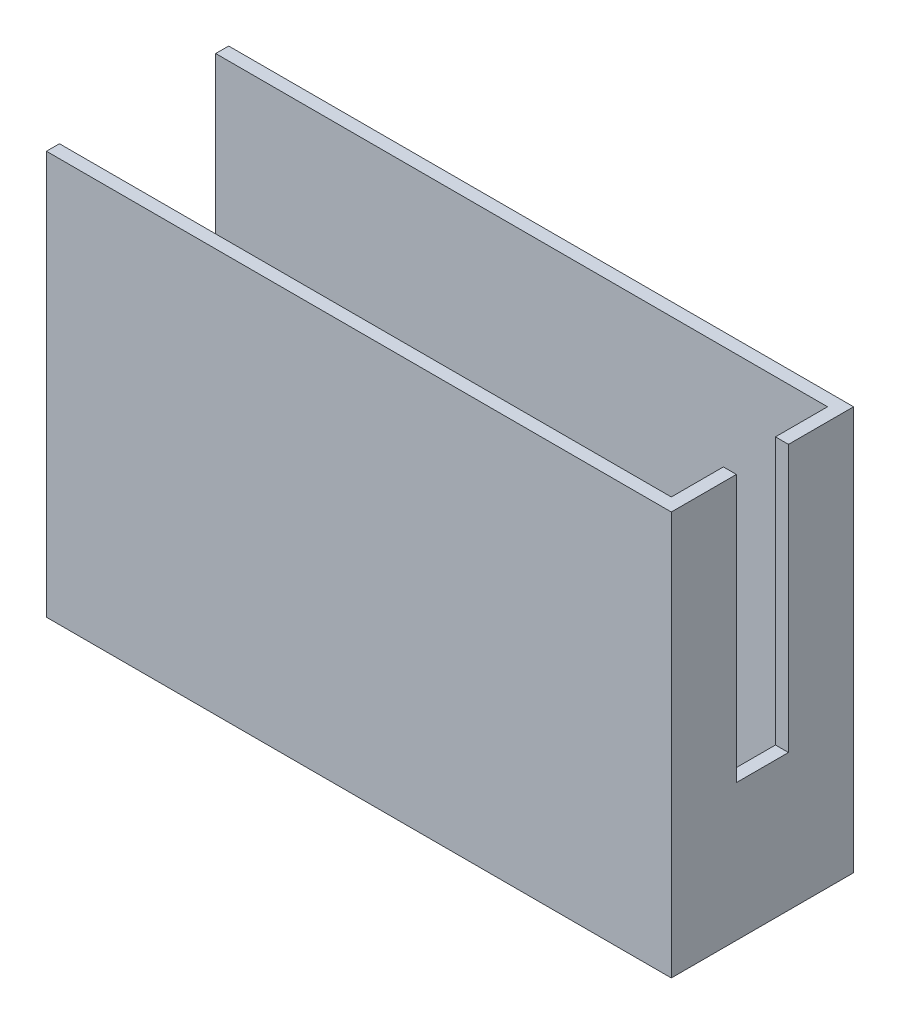
ISO-10303-21;
HEADER;
FILE_DESCRIPTION(('STEP AP214'),'2;1');
FILE_NAME('part.step','',(''),(''),'','','');
FILE_SCHEMA(('AUTOMOTIVE_DESIGN { 1 0 10303 214 1 1 1 1 }'));
ENDSEC;
DATA;
#1=APPLICATION_CONTEXT('core data for automotive mechanical design processes');
#2=APPLICATION_PROTOCOL_DEFINITION('international standard','automotive_design',2000,#1);
#3=PRODUCT_CONTEXT('',#1,'mechanical');
#4=PRODUCT('Part','Part','',(#3));
#5=PRODUCT_RELATED_PRODUCT_CATEGORY('part','',(#4));
#6=PRODUCT_DEFINITION_FORMATION('','',#4);
#7=PRODUCT_DEFINITION_CONTEXT('part definition',#1,'design');
#8=PRODUCT_DEFINITION('design','',#6,#7);
#9=PRODUCT_DEFINITION_SHAPE('','',#8);
#10=(LENGTH_UNIT() NAMED_UNIT(*) SI_UNIT(.MILLI.,.METRE.));
#11=(NAMED_UNIT(*) PLANE_ANGLE_UNIT() SI_UNIT($,.RADIAN.));
#12=(NAMED_UNIT(*) SI_UNIT($,.STERADIAN.) SOLID_ANGLE_UNIT());
#13=UNCERTAINTY_MEASURE_WITH_UNIT(LENGTH_MEASURE(1.E-05),#10,'distance_accuracy_value','');
#14=(GEOMETRIC_REPRESENTATION_CONTEXT(3) GLOBAL_UNCERTAINTY_ASSIGNED_CONTEXT((#13)) GLOBAL_UNIT_ASSIGNED_CONTEXT((#10,
#11,#12)) REPRESENTATION_CONTEXT('',''));
#15=CARTESIAN_POINT('',(0.,0.,0.));
#16=DIRECTION('',(0.,0.,1.));
#17=DIRECTION('',(1.,0.,0.));
#18=AXIS2_PLACEMENT_3D('',#15,#16,#17);
#19=CARTESIAN_POINT('',(0.,62.,0.));
#20=DIRECTION('',(0.,-1.,0.));
#21=DIRECTION('',(0.,0.,-1.));
#22=AXIS2_PLACEMENT_3D('',#19,#20,#21);
#23=PLANE('',#22);
#24=DIRECTION('',(0.,0.,1.));
#25=VECTOR('',#24,1.);
#26=CARTESIAN_POINT('',(0.,62.,0.));
#27=LINE('',#26,#25);
#28=CARTESIAN_POINT('',(0.,62.,-28.));
#29=VERTEX_POINT('',#28);
#30=CARTESIAN_POINT('',(0.,62.,-26.));
#31=VERTEX_POINT('',#30);
#32=EDGE_CURVE('E236',#29,#31,#27,.T.);
#33=ORIENTED_EDGE('',*,*,#32,.T.);
#34=DIRECTION('',(-1.,0.,0.));
#35=VECTOR('',#34,1.);
#36=CARTESIAN_POINT('',(2.,62.,-26.));
#37=LINE('',#36,#35);
#38=CARTESIAN_POINT('',(94.,62.,-26.));
#39=VERTEX_POINT('',#38);
#40=EDGE_CURVE('E156',#39,#31,#37,.T.);
#41=ORIENTED_EDGE('',*,*,#40,.F.);
#42=DIRECTION('',(0.,0.,-1.));
#43=VECTOR('',#42,1.);
#44=CARTESIAN_POINT('',(94.,62.,-2.));
#45=LINE('',#44,#43);
#46=CARTESIAN_POINT('',(94.,62.,-18.));
#47=VERTEX_POINT('',#46);
#48=EDGE_CURVE('E215',#47,#39,#45,.T.);
#49=ORIENTED_EDGE('',*,*,#48,.F.);
#50=DIRECTION('',(1.,0.,0.));
#51=VECTOR('',#50,1.);
#52=CARTESIAN_POINT('',(84.,62.,-18.));
#53=LINE('',#52,#51);
#54=CARTESIAN_POINT('',(96.,62.,-18.));
#55=VERTEX_POINT('',#54);
#56=EDGE_CURVE('E184',#47,#55,#53,.T.);
#57=ORIENTED_EDGE('',*,*,#56,.T.);
#58=DIRECTION('',(0.,0.,-1.));
#59=VECTOR('',#58,1.);
#60=CARTESIAN_POINT('',(96.,62.,0.));
#61=LINE('',#60,#59);
#62=CARTESIAN_POINT('',(96.,62.,-28.));
#63=VERTEX_POINT('',#62);
#64=EDGE_CURVE('E243',#55,#63,#61,.T.);
#65=ORIENTED_EDGE('',*,*,#64,.T.);
#66=DIRECTION('',(-1.,0.,0.));
#67=VECTOR('',#66,1.);
#68=CARTESIAN_POINT('',(0.,62.,-28.));
#69=LINE('',#68,#67);
#70=EDGE_CURVE('E248',#63,#29,#69,.T.);
#71=ORIENTED_EDGE('',*,*,#70,.T.);
#72=EDGE_LOOP('',(#33,#41,#49,#57,#65,#71));
#73=FACE_BOUND('',#72,.T.);
#74=ADVANCED_FACE('F39',(#73),#23,.F.);
#75=CARTESIAN_POINT('',(0.,62.,0.));
#76=DIRECTION('',(1.,0.,0.));
#77=DIRECTION('',(0.,0.,-1.));
#78=AXIS2_PLACEMENT_3D('',#75,#76,#77);
#79=PLANE('',#78);
#80=DIRECTION('',(0.,0.,1.));
#81=VECTOR('',#80,1.);
#82=CARTESIAN_POINT('',(0.,15.,-26.));
#83=LINE('',#82,#81);
#84=CARTESIAN_POINT('',(0.,15.,-26.));
#85=VERTEX_POINT('',#84);
#86=CARTESIAN_POINT('',(0.,15.,-2.));
#87=VERTEX_POINT('',#86);
#88=EDGE_CURVE('E143',#85,#87,#83,.T.);
#89=ORIENTED_EDGE('',*,*,#88,.F.);
#90=DIRECTION('',(0.,-1.,0.));
#91=VECTOR('',#90,1.);
#92=CARTESIAN_POINT('',(0.,62.,-26.));
#93=LINE('',#92,#91);
#94=EDGE_CURVE('E152',#31,#85,#93,.T.);
#95=ORIENTED_EDGE('',*,*,#94,.F.);
#96=ORIENTED_EDGE('',*,*,#32,.F.);
#97=DIRECTION('',(0.,-1.,0.));
#98=VECTOR('',#97,1.);
#99=CARTESIAN_POINT('',(0.,62.,-28.));
#100=LINE('',#99,#98);
#101=CARTESIAN_POINT('',(0.,0.,-28.));
#102=VERTEX_POINT('',#101);
#103=EDGE_CURVE('E251',#29,#102,#100,.T.);
#104=ORIENTED_EDGE('',*,*,#103,.T.);
#105=DIRECTION('',(0.,0.,1.));
#106=VECTOR('',#105,1.);
#107=CARTESIAN_POINT('',(0.,0.,0.));
#108=LINE('',#107,#106);
#109=CARTESIAN_POINT('',(0.,0.,0.));
#110=VERTEX_POINT('',#109);
#111=EDGE_CURVE('E225',#102,#110,#108,.T.);
#112=ORIENTED_EDGE('',*,*,#111,.T.);
#113=DIRECTION('',(0.,-1.,0.));
#114=VECTOR('',#113,1.);
#115=CARTESIAN_POINT('',(0.,62.,0.));
#116=LINE('',#115,#114);
#117=CARTESIAN_POINT('',(0.,62.,0.));
#118=VERTEX_POINT('',#117);
#119=EDGE_CURVE('E275',#118,#110,#116,.T.);
#120=ORIENTED_EDGE('',*,*,#119,.F.);
#121=CARTESIAN_POINT('',(0.,62.,-2.));
#122=VERTEX_POINT('',#121);
#123=EDGE_CURVE('E240',#122,#118,#27,.T.);
#124=ORIENTED_EDGE('',*,*,#123,.F.);
#125=DIRECTION('',(0.,1.,0.));
#126=VECTOR('',#125,1.);
#127=CARTESIAN_POINT('',(0.,62.,-2.));
#128=LINE('',#127,#126);
#129=EDGE_CURVE('E149',#87,#122,#128,.T.);
#130=ORIENTED_EDGE('',*,*,#129,.F.);
#131=EDGE_LOOP('',(#89,#95,#96,#104,#112,#120,#124,#130));
#132=FACE_BOUND('',#131,.T.);
#133=ADVANCED_FACE('F41',(#132),#79,.F.);
#134=CARTESIAN_POINT('',(0.,62.,0.));
#135=DIRECTION('',(0.,0.,-1.));
#136=DIRECTION('',(-1.,0.,0.));
#137=AXIS2_PLACEMENT_3D('',#134,#135,#136);
#138=PLANE('',#137);
#139=DIRECTION('',(1.,0.,0.));
#140=VECTOR('',#139,1.);
#141=CARTESIAN_POINT('',(0.,0.,0.));
#142=LINE('',#141,#140);
#143=CARTESIAN_POINT('',(96.,0.,0.));
#144=VERTEX_POINT('',#143);
#145=EDGE_CURVE('E255',#110,#144,#142,.T.);
#146=ORIENTED_EDGE('',*,*,#145,.T.);
#147=DIRECTION('',(0.,-1.,0.));
#148=VECTOR('',#147,1.);
#149=CARTESIAN_POINT('',(96.,62.,0.));
#150=LINE('',#149,#148);
#151=CARTESIAN_POINT('',(96.,62.,0.));
#152=VERTEX_POINT('',#151);
#153=EDGE_CURVE('E271',#152,#144,#150,.T.);
#154=ORIENTED_EDGE('',*,*,#153,.F.);
#155=DIRECTION('',(1.,0.,0.));
#156=VECTOR('',#155,1.);
#157=CARTESIAN_POINT('',(0.,62.,0.));
#158=LINE('',#157,#156);
#159=EDGE_CURVE('E239',#118,#152,#158,.T.);
#160=ORIENTED_EDGE('',*,*,#159,.F.);
#161=ORIENTED_EDGE('',*,*,#119,.T.);
#162=EDGE_LOOP('',(#146,#154,#160,#161));
#163=FACE_BOUND('',#162,.T.);
#164=ADVANCED_FACE('F316',(#163),#138,.F.);
#165=CARTESIAN_POINT('',(96.,62.,0.));
#166=DIRECTION('',(-1.,0.,0.));
#167=DIRECTION('',(0.,0.,1.));
#168=AXIS2_PLACEMENT_3D('',#165,#166,#167);
#169=PLANE('',#168);
#170=ORIENTED_EDGE('',*,*,#64,.F.);
#171=DIRECTION('',(0.,1.,0.));
#172=VECTOR('',#171,1.);
#173=CARTESIAN_POINT('',(96.,62.,-18.));
#174=LINE('',#173,#172);
#175=CARTESIAN_POINT('',(96.,21.,-18.));
#176=VERTEX_POINT('',#175);
#177=EDGE_CURVE('E180',#176,#55,#174,.T.);
#178=ORIENTED_EDGE('',*,*,#177,.F.);
#179=DIRECTION('',(0.,0.,-1.));
#180=VECTOR('',#179,1.);
#181=CARTESIAN_POINT('',(96.,21.,-18.));
#182=LINE('',#181,#180);
#183=CARTESIAN_POINT('',(96.,21.,-10.));
#184=VERTEX_POINT('',#183);
#185=EDGE_CURVE('E176',#184,#176,#182,.T.);
#186=ORIENTED_EDGE('',*,*,#185,.F.);
#187=DIRECTION('',(0.,-1.,0.));
#188=VECTOR('',#187,1.);
#189=CARTESIAN_POINT('',(96.,62.,-10.));
#190=LINE('',#189,#188);
#191=CARTESIAN_POINT('',(96.,62.,-10.));
#192=VERTEX_POINT('',#191);
#193=EDGE_CURVE('E173',#192,#184,#190,.T.);
#194=ORIENTED_EDGE('',*,*,#193,.F.);
#195=EDGE_CURVE('E244',#152,#192,#61,.T.);
#196=ORIENTED_EDGE('',*,*,#195,.F.);
#197=ORIENTED_EDGE('',*,*,#153,.T.);
#198=DIRECTION('',(0.,0.,-1.));
#199=VECTOR('',#198,1.);
#200=CARTESIAN_POINT('',(96.,0.,0.));
#201=LINE('',#200,#199);
#202=CARTESIAN_POINT('',(96.,0.,-28.));
#203=VERTEX_POINT('',#202);
#204=EDGE_CURVE('E258',#144,#203,#201,.T.);
#205=ORIENTED_EDGE('',*,*,#204,.T.);
#206=DIRECTION('',(0.,-1.,0.));
#207=VECTOR('',#206,1.);
#208=CARTESIAN_POINT('',(96.,62.,-28.));
#209=LINE('',#208,#207);
#210=EDGE_CURVE('E267',#63,#203,#209,.T.);
#211=ORIENTED_EDGE('',*,*,#210,.F.);
#212=EDGE_LOOP('',(#170,#178,#186,#194,#196,#197,#205,#211));
#213=FACE_BOUND('',#212,.T.);
#214=ADVANCED_FACE('F298',(#213),#169,.F.);
#215=CARTESIAN_POINT('',(0.,62.,-28.));
#216=DIRECTION('',(0.,0.,1.));
#217=DIRECTION('',(1.,0.,0.));
#218=AXIS2_PLACEMENT_3D('',#215,#216,#217);
#219=PLANE('',#218);
#220=DIRECTION('',(-1.,0.,0.));
#221=VECTOR('',#220,1.);
#222=CARTESIAN_POINT('',(0.,0.,-28.));
#223=LINE('',#222,#221);
#224=EDGE_CURVE('E261',#203,#102,#223,.T.);
#225=ORIENTED_EDGE('',*,*,#224,.T.);
#226=ORIENTED_EDGE('',*,*,#103,.F.);
#227=ORIENTED_EDGE('',*,*,#70,.F.);
#228=ORIENTED_EDGE('',*,*,#210,.T.);
#229=EDGE_LOOP('',(#225,#226,#227,#228));
#230=FACE_BOUND('',#229,.T.);
#231=ADVANCED_FACE('F347',(#230),#219,.F.);
#232=DIRECTION('',(1.,0.,0.));
#233=VECTOR('',#232,1.);
#234=CARTESIAN_POINT('',(2.,62.,-2.));
#235=LINE('',#234,#233);
#236=CARTESIAN_POINT('',(94.,62.,-2.));
#237=VERTEX_POINT('',#236);
#238=EDGE_CURVE('E188',#122,#237,#235,.T.);
#239=ORIENTED_EDGE('',*,*,#238,.F.);
#240=ORIENTED_EDGE('',*,*,#123,.T.);
#241=ORIENTED_EDGE('',*,*,#159,.T.);
#242=ORIENTED_EDGE('',*,*,#195,.T.);
#243=DIRECTION('',(1.,0.,0.));
#244=VECTOR('',#243,1.);
#245=CARTESIAN_POINT('',(84.,62.,-10.));
#246=LINE('',#245,#244);
#247=CARTESIAN_POINT('',(94.,62.,-10.));
#248=VERTEX_POINT('',#247);
#249=EDGE_CURVE('E183',#248,#192,#246,.T.);
#250=ORIENTED_EDGE('',*,*,#249,.F.);
#251=EDGE_CURVE('E216',#237,#248,#45,.T.);
#252=ORIENTED_EDGE('',*,*,#251,.F.);
#253=EDGE_LOOP('',(#239,#240,#241,#242,#250,#252));
#254=FACE_BOUND('',#253,.T.);
#255=ADVANCED_FACE('F318',(#254),#23,.F.);
#256=CARTESIAN_POINT('',(0.,0.,0.));
#257=DIRECTION('',(0.,-1.,0.));
#258=DIRECTION('',(0.,0.,-1.));
#259=AXIS2_PLACEMENT_3D('',#256,#257,#258);
#260=PLANE('',#259);
#261=ORIENTED_EDGE('',*,*,#111,.F.);
#262=ORIENTED_EDGE('',*,*,#224,.F.);
#263=ORIENTED_EDGE('',*,*,#204,.F.);
#264=ORIENTED_EDGE('',*,*,#145,.F.);
#265=EDGE_LOOP('',(#261,#262,#263,#264));
#266=FACE_BOUND('',#265,.T.);
#267=ADVANCED_FACE('F311',(#266),#260,.T.);
#268=CARTESIAN_POINT('',(2.,2.,-2.));
#269=DIRECTION('',(-1.,0.,0.));
#270=DIRECTION('',(0.,0.,1.));
#271=AXIS2_PLACEMENT_3D('',#268,#269,#270);
#272=PLANE('',#271);
#273=DIRECTION('',(0.,1.,0.));
#274=VECTOR('',#273,1.);
#275=CARTESIAN_POINT('',(2.,2.,-26.));
#276=LINE('',#275,#274);
#277=CARTESIAN_POINT('',(2.,2.,-26.));
#278=VERTEX_POINT('',#277);
#279=CARTESIAN_POINT('',(2.,15.,-26.));
#280=VERTEX_POINT('',#279);
#281=EDGE_CURVE('E222',#278,#280,#276,.T.);
#282=ORIENTED_EDGE('',*,*,#281,.T.);
#283=DIRECTION('',(0.,0.,1.));
#284=VECTOR('',#283,1.);
#285=CARTESIAN_POINT('',(2.,15.,-2.));
#286=LINE('',#285,#284);
#287=CARTESIAN_POINT('',(2.,15.,-2.));
#288=VERTEX_POINT('',#287);
#289=EDGE_CURVE('E145',#280,#288,#286,.T.);
#290=ORIENTED_EDGE('',*,*,#289,.T.);
#291=DIRECTION('',(0.,1.,0.));
#292=VECTOR('',#291,1.);
#293=CARTESIAN_POINT('',(2.,2.,-2.));
#294=LINE('',#293,#292);
#295=CARTESIAN_POINT('',(2.,2.,-2.));
#296=VERTEX_POINT('',#295);
#297=EDGE_CURVE('E212',#296,#288,#294,.T.);
#298=ORIENTED_EDGE('',*,*,#297,.F.);
#299=DIRECTION('',(0.,0.,1.));
#300=VECTOR('',#299,1.);
#301=CARTESIAN_POINT('',(2.,2.,-2.));
#302=LINE('',#301,#300);
#303=EDGE_CURVE('E196',#278,#296,#302,.T.);
#304=ORIENTED_EDGE('',*,*,#303,.F.);
#305=EDGE_LOOP('',(#282,#290,#298,#304));
#306=FACE_BOUND('',#305,.T.);
#307=ADVANCED_FACE('F326',(#306),#272,.F.);
#308=CARTESIAN_POINT('',(2.,2.,-26.));
#309=DIRECTION('',(0.,0.,-1.));
#310=DIRECTION('',(-1.,0.,0.));
#311=AXIS2_PLACEMENT_3D('',#308,#309,#310);
#312=PLANE('',#311);
#313=ORIENTED_EDGE('',*,*,#40,.T.);
#314=ORIENTED_EDGE('',*,*,#94,.T.);
#315=DIRECTION('',(-1.,0.,0.));
#316=VECTOR('',#315,1.);
#317=CARTESIAN_POINT('',(10.,15.,-26.));
#318=LINE('',#317,#316);
#319=EDGE_CURVE('E139',#280,#85,#318,.T.);
#320=ORIENTED_EDGE('',*,*,#319,.F.);
#321=ORIENTED_EDGE('',*,*,#281,.F.);
#322=DIRECTION('',(-1.,0.,0.));
#323=VECTOR('',#322,1.);
#324=CARTESIAN_POINT('',(2.,2.,-26.));
#325=LINE('',#324,#323);
#326=CARTESIAN_POINT('',(94.,2.,-26.));
#327=VERTEX_POINT('',#326);
#328=EDGE_CURVE('E208',#327,#278,#325,.T.);
#329=ORIENTED_EDGE('',*,*,#328,.F.);
#330=DIRECTION('',(0.,1.,0.));
#331=VECTOR('',#330,1.);
#332=CARTESIAN_POINT('',(94.,2.,-26.));
#333=LINE('',#332,#331);
#334=EDGE_CURVE('E226',#327,#39,#333,.T.);
#335=ORIENTED_EDGE('',*,*,#334,.T.);
#336=EDGE_LOOP('',(#313,#314,#320,#321,#329,#335));
#337=FACE_BOUND('',#336,.T.);
#338=ADVANCED_FACE('F153',(#337),#312,.F.);
#339=CARTESIAN_POINT('',(94.,2.,-2.));
#340=DIRECTION('',(1.,0.,0.));
#341=DIRECTION('',(0.,0.,-1.));
#342=AXIS2_PLACEMENT_3D('',#339,#340,#341);
#343=PLANE('',#342);
#344=DIRECTION('',(0.,0.,-1.));
#345=VECTOR('',#344,1.);
#346=CARTESIAN_POINT('',(94.,21.,-2.));
#347=LINE('',#346,#345);
#348=CARTESIAN_POINT('',(94.,21.,-10.));
#349=VERTEX_POINT('',#348);
#350=CARTESIAN_POINT('',(94.,21.,-18.));
#351=VERTEX_POINT('',#350);
#352=EDGE_CURVE('E48',#349,#351,#347,.T.);
#353=ORIENTED_EDGE('',*,*,#352,.T.);
#354=DIRECTION('',(0.,1.,0.));
#355=VECTOR('',#354,1.);
#356=CARTESIAN_POINT('',(94.,2.,-18.));
#357=LINE('',#356,#355);
#358=EDGE_CURVE('E11',#351,#47,#357,.T.);
#359=ORIENTED_EDGE('',*,*,#358,.T.);
#360=ORIENTED_EDGE('',*,*,#48,.T.);
#361=ORIENTED_EDGE('',*,*,#334,.F.);
#362=DIRECTION('',(0.,0.,-1.));
#363=VECTOR('',#362,1.);
#364=CARTESIAN_POINT('',(94.,2.,-2.));
#365=LINE('',#364,#363);
#366=CARTESIAN_POINT('',(94.,2.,-2.));
#367=VERTEX_POINT('',#366);
#368=EDGE_CURVE('E204',#367,#327,#365,.T.);
#369=ORIENTED_EDGE('',*,*,#368,.F.);
#370=DIRECTION('',(0.,1.,0.));
#371=VECTOR('',#370,1.);
#372=CARTESIAN_POINT('',(94.,2.,-2.));
#373=LINE('',#372,#371);
#374=EDGE_CURVE('E229',#367,#237,#373,.T.);
#375=ORIENTED_EDGE('',*,*,#374,.T.);
#376=ORIENTED_EDGE('',*,*,#251,.T.);
#377=DIRECTION('',(0.,-1.,0.));
#378=VECTOR('',#377,1.);
#379=CARTESIAN_POINT('',(94.,2.,-10.));
#380=LINE('',#379,#378);
#381=EDGE_CURVE('E279',#248,#349,#380,.T.);
#382=ORIENTED_EDGE('',*,*,#381,.T.);
#383=EDGE_LOOP('',(#353,#359,#360,#361,#369,#375,#376,#382));
#384=FACE_BOUND('',#383,.T.);
#385=ADVANCED_FACE('F285',(#384),#343,.F.);
#386=CARTESIAN_POINT('',(2.,2.,-2.));
#387=DIRECTION('',(0.,0.,1.));
#388=DIRECTION('',(1.,0.,0.));
#389=AXIS2_PLACEMENT_3D('',#386,#387,#388);
#390=PLANE('',#389);
#391=ORIENTED_EDGE('',*,*,#297,.T.);
#392=DIRECTION('',(-1.,0.,0.));
#393=VECTOR('',#392,1.);
#394=CARTESIAN_POINT('',(10.,15.,-2.));
#395=LINE('',#394,#393);
#396=EDGE_CURVE('E55',#288,#87,#395,.T.);
#397=ORIENTED_EDGE('',*,*,#396,.T.);
#398=ORIENTED_EDGE('',*,*,#129,.T.);
#399=ORIENTED_EDGE('',*,*,#238,.T.);
#400=ORIENTED_EDGE('',*,*,#374,.F.);
#401=DIRECTION('',(1.,0.,0.));
#402=VECTOR('',#401,1.);
#403=CARTESIAN_POINT('',(2.,2.,-2.));
#404=LINE('',#403,#402);
#405=EDGE_CURVE('E200',#296,#367,#404,.T.);
#406=ORIENTED_EDGE('',*,*,#405,.F.);
#407=EDGE_LOOP('',(#391,#397,#398,#399,#400,#406));
#408=FACE_BOUND('',#407,.T.);
#409=ADVANCED_FACE('F322',(#408),#390,.F.);
#410=CARTESIAN_POINT('',(0.,2.,0.));
#411=DIRECTION('',(0.,-1.,0.));
#412=DIRECTION('',(0.,0.,-1.));
#413=AXIS2_PLACEMENT_3D('',#410,#411,#412);
#414=PLANE('',#413);
#415=ORIENTED_EDGE('',*,*,#303,.T.);
#416=ORIENTED_EDGE('',*,*,#405,.T.);
#417=ORIENTED_EDGE('',*,*,#368,.T.);
#418=ORIENTED_EDGE('',*,*,#328,.T.);
#419=EDGE_LOOP('',(#415,#416,#417,#418));
#420=FACE_BOUND('',#419,.T.);
#421=ADVANCED_FACE('F328',(#420),#414,.F.);
#422=CARTESIAN_POINT('',(84.,62.,-18.));
#423=DIRECTION('',(0.,0.,-1.));
#424=DIRECTION('',(-1.,0.,0.));
#425=AXIS2_PLACEMENT_3D('',#422,#423,#424);
#426=PLANE('',#425);
#427=DIRECTION('',(1.,0.,0.));
#428=VECTOR('',#427,1.);
#429=CARTESIAN_POINT('',(84.,21.,-18.));
#430=LINE('',#429,#428);
#431=EDGE_CURVE('E189',#351,#176,#430,.T.);
#432=ORIENTED_EDGE('',*,*,#431,.T.);
#433=ORIENTED_EDGE('',*,*,#177,.T.);
#434=ORIENTED_EDGE('',*,*,#56,.F.);
#435=ORIENTED_EDGE('',*,*,#358,.F.);
#436=EDGE_LOOP('',(#432,#433,#434,#435));
#437=FACE_BOUND('',#436,.T.);
#438=ADVANCED_FACE('F293',(#437),#426,.F.);
#439=CARTESIAN_POINT('',(84.,21.,-18.));
#440=DIRECTION('',(0.,-1.,0.));
#441=DIRECTION('',(0.,0.,-1.));
#442=AXIS2_PLACEMENT_3D('',#439,#440,#441);
#443=PLANE('',#442);
#444=DIRECTION('',(1.,0.,0.));
#445=VECTOR('',#444,1.);
#446=CARTESIAN_POINT('',(84.,21.,-10.));
#447=LINE('',#446,#445);
#448=EDGE_CURVE('E63',#349,#184,#447,.T.);
#449=ORIENTED_EDGE('',*,*,#448,.T.);
#450=ORIENTED_EDGE('',*,*,#185,.T.);
#451=ORIENTED_EDGE('',*,*,#431,.F.);
#452=ORIENTED_EDGE('',*,*,#352,.F.);
#453=EDGE_LOOP('',(#449,#450,#451,#452));
#454=FACE_BOUND('',#453,.T.);
#455=ADVANCED_FACE('F289',(#454),#443,.F.);
#456=CARTESIAN_POINT('',(84.,62.,-10.));
#457=DIRECTION('',(0.,0.,1.));
#458=DIRECTION('',(0.,-1.,0.));
#459=AXIS2_PLACEMENT_3D('',#456,#457,#458);
#460=PLANE('',#459);
#461=ORIENTED_EDGE('',*,*,#249,.T.);
#462=ORIENTED_EDGE('',*,*,#193,.T.);
#463=ORIENTED_EDGE('',*,*,#448,.F.);
#464=ORIENTED_EDGE('',*,*,#381,.F.);
#465=EDGE_LOOP('',(#461,#462,#463,#464));
#466=FACE_BOUND('',#465,.T.);
#467=ADVANCED_FACE('F396',(#466),#460,.F.);
#468=CARTESIAN_POINT('',(10.,15.,-26.));
#469=DIRECTION('',(0.,-1.,0.));
#470=DIRECTION('',(0.,0.,-1.));
#471=AXIS2_PLACEMENT_3D('',#468,#469,#470);
#472=PLANE('',#471);
#473=ORIENTED_EDGE('',*,*,#319,.T.);
#474=ORIENTED_EDGE('',*,*,#88,.T.);
#475=ORIENTED_EDGE('',*,*,#396,.F.);
#476=ORIENTED_EDGE('',*,*,#289,.F.);
#477=EDGE_LOOP('',(#473,#474,#475,#476));
#478=FACE_BOUND('',#477,.T.);
#479=ADVANCED_FACE('F141',(#478),#472,.F.);
#480=CLOSED_SHELL('',(#74,#133,#164,#214,#231,#255,#267,#307,#338,#385,#409,#421,#438,#455,#467,#479));
#481=MANIFOLD_SOLID_BREP('B2',#480);
#482=ADVANCED_BREP_SHAPE_REPRESENTATION('',(#18,#481),#14);
#483=SHAPE_DEFINITION_REPRESENTATION(#9,#482);
ENDSEC;
END-ISO-10303-21;
